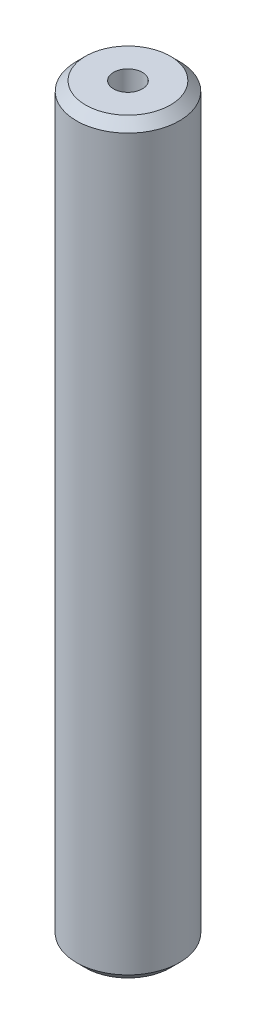
ISO-10303-21;
HEADER;
FILE_DESCRIPTION(('STEP AP214'),'2;1');
FILE_NAME('part.step','',(''),(''),'','','');
FILE_SCHEMA(('AUTOMOTIVE_DESIGN { 1 0 10303 214 1 1 1 1 }'));
ENDSEC;
DATA;
#1=APPLICATION_CONTEXT('core data for automotive mechanical design processes');
#2=APPLICATION_PROTOCOL_DEFINITION('international standard','automotive_design',2000,#1);
#3=PRODUCT_CONTEXT('',#1,'mechanical');
#4=PRODUCT('Part','Part','',(#3));
#5=PRODUCT_RELATED_PRODUCT_CATEGORY('part','',(#4));
#6=PRODUCT_DEFINITION_FORMATION('','',#4);
#7=PRODUCT_DEFINITION_CONTEXT('part definition',#1,'design');
#8=PRODUCT_DEFINITION('design','',#6,#7);
#9=PRODUCT_DEFINITION_SHAPE('','',#8);
#10=(LENGTH_UNIT() NAMED_UNIT(*) SI_UNIT(.MILLI.,.METRE.));
#11=(NAMED_UNIT(*) PLANE_ANGLE_UNIT() SI_UNIT($,.RADIAN.));
#12=(NAMED_UNIT(*) SI_UNIT($,.STERADIAN.) SOLID_ANGLE_UNIT());
#13=UNCERTAINTY_MEASURE_WITH_UNIT(LENGTH_MEASURE(1.E-05),#10,'distance_accuracy_value','');
#14=(GEOMETRIC_REPRESENTATION_CONTEXT(3) GLOBAL_UNCERTAINTY_ASSIGNED_CONTEXT((#13)) GLOBAL_UNIT_ASSIGNED_CONTEXT((#10,
#11,#12)) REPRESENTATION_CONTEXT('',''));
#15=CARTESIAN_POINT('',(0.,0.,0.));
#16=DIRECTION('',(0.,0.,1.));
#17=DIRECTION('',(1.,0.,0.));
#18=AXIS2_PLACEMENT_3D('',#15,#16,#17);
#19=CARTESIAN_POINT('',(0.,145.123616745822,0.));
#20=DIRECTION('',(0.,-1.,0.));
#21=DIRECTION('',(0.,0.,-1.));
#22=AXIS2_PLACEMENT_3D('',#19,#20,#21);
#23=CYLINDRICAL_SURFACE('',#22,10.);
#24=CARTESIAN_POINT('',(0.,143.353737359322,0.));
#25=DIRECTION('',(0.,1.,0.));
#26=DIRECTION('',(0.,0.,1.));
#27=AXIS2_PLACEMENT_3D('',#24,#25,#26);
#28=CIRCLE('',#27,10.);
#29=CARTESIAN_POINT('',(0.,143.353737359322,10.));
#30=VERTEX_POINT('',#29);
#31=EDGE_CURVE('E50',#30,#30,#28,.F.);
#32=ORIENTED_EDGE('',*,*,#31,.T.);
#33=EDGE_LOOP('',(#32));
#34=FACE_BOUND('',#33,.T.);
#35=CARTESIAN_POINT('',(0.,1.76987938649981,0.));
#36=DIRECTION('',(0.,1.,0.));
#37=DIRECTION('',(0.,0.,1.));
#38=AXIS2_PLACEMENT_3D('',#35,#36,#37);
#39=CIRCLE('',#38,10.);
#40=CARTESIAN_POINT('',(0.,1.76987938649981,10.));
#41=VERTEX_POINT('',#40);
#42=EDGE_CURVE('E51',#41,#41,#39,.T.);
#43=ORIENTED_EDGE('',*,*,#42,.T.);
#44=EDGE_LOOP('',(#43));
#45=FACE_BOUND('',#44,.T.);
#46=ADVANCED_FACE('F39',(#34,#45),#23,.T.);
#47=CARTESIAN_POINT('',(0.,145.123616745822,0.));
#48=DIRECTION('',(0.,1.,0.));
#49=DIRECTION('',(0.,0.,1.));
#50=AXIS2_PLACEMENT_3D('',#47,#48,#49);
#51=PLANE('',#50);
#52=CARTESIAN_POINT('',(0.,145.123616745822,0.));
#53=DIRECTION('',(0.,1.,0.));
#54=DIRECTION('',(0.,0.,1.));
#55=AXIS2_PLACEMENT_3D('',#52,#53,#54);
#56=CIRCLE('',#55,8.23012061350016);
#57=CARTESIAN_POINT('',(0.,145.123616745822,8.23012061350016));
#58=VERTEX_POINT('',#57);
#59=EDGE_CURVE('E54',#58,#58,#56,.T.);
#60=ORIENTED_EDGE('',*,*,#59,.T.);
#61=EDGE_LOOP('',(#60));
#62=FACE_BOUND('',#61,.T.);
#63=CARTESIAN_POINT('',(0.,145.123616745822,0.));
#64=DIRECTION('',(0.,1.,0.));
#65=DIRECTION('',(0.,0.,1.));
#66=AXIS2_PLACEMENT_3D('',#63,#64,#65);
#67=CIRCLE('',#66,2.79623342329604);
#68=CARTESIAN_POINT('',(0.,145.123616745822,2.79623342329604));
#69=VERTEX_POINT('',#68);
#70=EDGE_CURVE('E58',#69,#69,#67,.T.);
#71=ORIENTED_EDGE('',*,*,#70,.F.);
#72=EDGE_LOOP('',(#71));
#73=FACE_BOUND('',#72,.T.);
#74=ADVANCED_FACE('F69',(#62,#73),#51,.T.);
#75=CARTESIAN_POINT('',(0.,0.,0.));
#76=DIRECTION('',(0.,1.,0.));
#77=DIRECTION('',(0.,0.,1.));
#78=AXIS2_PLACEMENT_3D('',#75,#76,#77);
#79=PLANE('',#78);
#80=CARTESIAN_POINT('',(0.,0.,0.));
#81=DIRECTION('',(0.,1.,0.));
#82=DIRECTION('',(0.,0.,1.));
#83=AXIS2_PLACEMENT_3D('',#80,#81,#82);
#84=CIRCLE('',#83,8.23012061350019);
#85=CARTESIAN_POINT('',(0.,0.,8.23012061350019));
#86=VERTEX_POINT('',#85);
#87=EDGE_CURVE('E10',#86,#86,#84,.F.);
#88=ORIENTED_EDGE('',*,*,#87,.T.);
#89=EDGE_LOOP('',(#88));
#90=FACE_BOUND('',#89,.T.);
#91=CARTESIAN_POINT('',(0.,0.,0.));
#92=DIRECTION('',(0.,1.,0.));
#93=DIRECTION('',(0.,0.,1.));
#94=AXIS2_PLACEMENT_3D('',#91,#92,#93);
#95=CIRCLE('',#94,2.79623342329604);
#96=CARTESIAN_POINT('',(0.,0.,2.79623342329604));
#97=VERTEX_POINT('',#96);
#98=EDGE_CURVE('E63',#97,#97,#95,.T.);
#99=ORIENTED_EDGE('',*,*,#98,.T.);
#100=EDGE_LOOP('',(#99));
#101=FACE_BOUND('',#100,.T.);
#102=ADVANCED_FACE('F75',(#90,#101),#79,.F.);
#103=CARTESIAN_POINT('',(0.,145.123616745822,0.));
#104=DIRECTION('',(0.,-1.,0.));
#105=DIRECTION('',(0.,0.,-1.));
#106=AXIS2_PLACEMENT_3D('',#103,#104,#105);
#107=CYLINDRICAL_SURFACE('',#106,2.79623342329604);
#108=ORIENTED_EDGE('',*,*,#70,.T.);
#109=EDGE_LOOP('',(#108));
#110=FACE_BOUND('',#109,.T.);
#111=ORIENTED_EDGE('',*,*,#98,.F.);
#112=EDGE_LOOP('',(#111));
#113=FACE_BOUND('',#112,.T.);
#114=ADVANCED_FACE('F70',(#110,#113),#107,.F.);
#115=CARTESIAN_POINT('',(0.,145.123616745822,0.));
#116=DIRECTION('',(0.,-1.,0.));
#117=DIRECTION('',(0.,0.,-1.));
#118=AXIS2_PLACEMENT_3D('',#115,#116,#117);
#119=CONICAL_SURFACE('',#118,8.23012061350016,0.78539816339745);
#120=ORIENTED_EDGE('',*,*,#31,.F.);
#121=EDGE_LOOP('',(#120));
#122=FACE_BOUND('',#121,.T.);
#123=ORIENTED_EDGE('',*,*,#59,.F.);
#124=EDGE_LOOP('',(#123));
#125=FACE_BOUND('',#124,.T.);
#126=ADVANCED_FACE('F81',(#122,#125),#119,.T.);
#127=CARTESIAN_POINT('',(0.,1.76987938649981,0.));
#128=DIRECTION('',(0.,1.,0.));
#129=DIRECTION('',(0.,0.,1.));
#130=AXIS2_PLACEMENT_3D('',#127,#128,#129);
#131=CONICAL_SURFACE('',#130,10.,0.78539816339745);
#132=ORIENTED_EDGE('',*,*,#87,.F.);
#133=EDGE_LOOP('',(#132));
#134=FACE_BOUND('',#133,.T.);
#135=ORIENTED_EDGE('',*,*,#42,.F.);
#136=EDGE_LOOP('',(#135));
#137=FACE_BOUND('',#136,.T.);
#138=ADVANCED_FACE('F45',(#134,#137),#131,.T.);
#139=CLOSED_SHELL('',(#46,#74,#102,#114,#126,#138));
#140=MANIFOLD_SOLID_BREP('B2',#139);
#141=ADVANCED_BREP_SHAPE_REPRESENTATION('',(#18,#140),#14);
#142=SHAPE_DEFINITION_REPRESENTATION(#9,#141);
ENDSEC;
END-ISO-10303-21;
